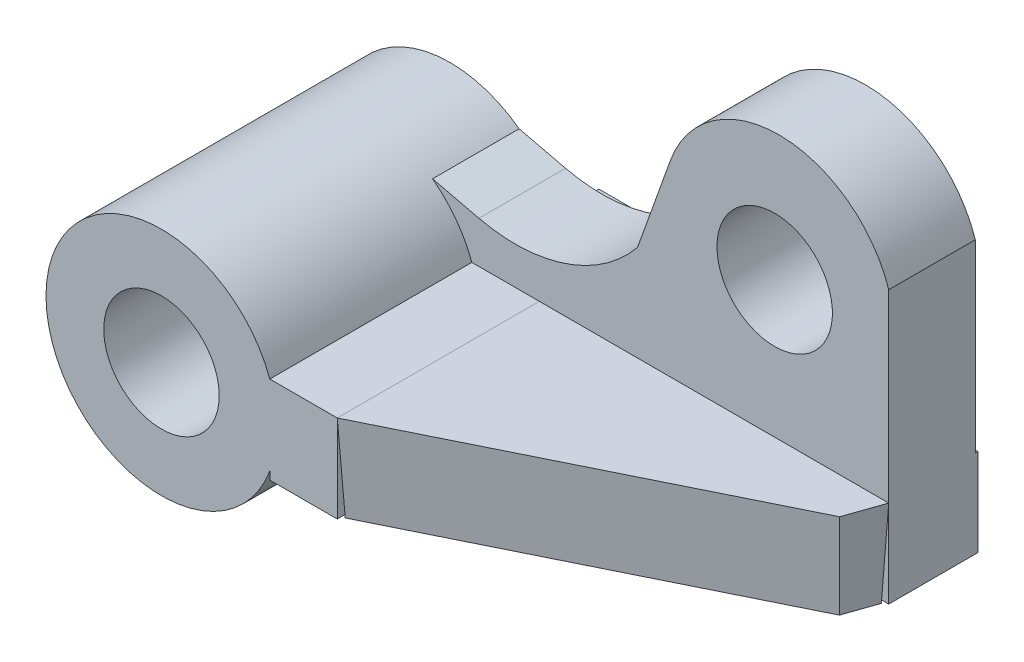
ISO-10303-21;
HEADER;
FILE_DESCRIPTION(('STEP AP214'),'2;1');
FILE_NAME('part.step','',(''),(''),'','','');
FILE_SCHEMA(('AUTOMOTIVE_DESIGN { 1 0 10303 214 1 1 1 1 }'));
ENDSEC;
DATA;
#1=APPLICATION_CONTEXT('core data for automotive mechanical design processes');
#2=APPLICATION_PROTOCOL_DEFINITION('international standard','automotive_design',2000,#1);
#3=PRODUCT_CONTEXT('',#1,'mechanical');
#4=PRODUCT('Part','Part','',(#3));
#5=PRODUCT_RELATED_PRODUCT_CATEGORY('part','',(#4));
#6=PRODUCT_DEFINITION_FORMATION('','',#4);
#7=PRODUCT_DEFINITION_CONTEXT('part definition',#1,'design');
#8=PRODUCT_DEFINITION('design','',#6,#7);
#9=PRODUCT_DEFINITION_SHAPE('','',#8);
#10=(LENGTH_UNIT() NAMED_UNIT(*) SI_UNIT(.MILLI.,.METRE.));
#11=(NAMED_UNIT(*) PLANE_ANGLE_UNIT() SI_UNIT($,.RADIAN.));
#12=(NAMED_UNIT(*) SI_UNIT($,.STERADIAN.) SOLID_ANGLE_UNIT());
#13=UNCERTAINTY_MEASURE_WITH_UNIT(LENGTH_MEASURE(1.E-05),#10,'distance_accuracy_value','');
#14=(GEOMETRIC_REPRESENTATION_CONTEXT(3) GLOBAL_UNCERTAINTY_ASSIGNED_CONTEXT((#13)) GLOBAL_UNIT_ASSIGNED_CONTEXT((#10,
#11,#12)) REPRESENTATION_CONTEXT('',''));
#15=CARTESIAN_POINT('',(0.,0.,0.));
#16=DIRECTION('',(0.,0.,1.));
#17=DIRECTION('',(1.,0.,0.));
#18=AXIS2_PLACEMENT_3D('',#15,#16,#17);
#19=CARTESIAN_POINT('',(30.4592069051177,6.89696913346013,-10.));
#20=DIRECTION('',(-0.999390827019096,-0.034899496702501,0.));
#21=DIRECTION('',(0.034899496702501,-0.999390827019096,0.));
#22=AXIS2_PLACEMENT_3D('',#19,#20,#21);
#23=PLANE('',#22);
#24=DIRECTION('',(0.,0.,1.));
#25=VECTOR('',#24,1.);
#26=CARTESIAN_POINT('',(30.4592069051177,6.89696913346013,-10.));
#27=LINE('',#26,#25);
#28=CARTESIAN_POINT('',(30.4592069051177,6.89696913346013,-10.));
#29=VERTEX_POINT('',#28);
#30=CARTESIAN_POINT('',(30.4592069051177,6.89696913346013,25.));
#31=VERTEX_POINT('',#30);
#32=EDGE_CURVE('E98',#29,#31,#27,.T.);
#33=ORIENTED_EDGE('',*,*,#32,.F.);
#34=DIRECTION('',(-0.0348782627423747,0.998782765958718,-0.0348782627423747));
#35=VECTOR('',#34,1.);
#36=CARTESIAN_POINT('',(30.5328336841421,4.78857404091006,-9.92637322097553));
#37=LINE('',#36,#35);
#38=CARTESIAN_POINT('',(30.9886318992094,-8.26377909165649,-9.47057500590828));
#39=VERTEX_POINT('',#38);
#40=EDGE_CURVE('E12',#39,#29,#37,.T.);
#41=ORIENTED_EDGE('',*,*,#40,.F.);
#42=DIRECTION('',(0.,0.,1.));
#43=VECTOR('',#42,1.);
#44=CARTESIAN_POINT('',(30.9886318992094,-8.26377909165649,-10.));
#45=LINE('',#44,#43);
#46=CARTESIAN_POINT('',(30.9886318992094,-8.26377909165649,24.1495847439697));
#47=VERTEX_POINT('',#46);
#48=EDGE_CURVE('E100',#39,#47,#45,.T.);
#49=ORIENTED_EDGE('',*,*,#48,.T.);
#50=DIRECTION('',(-0.0348447877303247,0.997824167035008,0.0559711751611641));
#51=VECTOR('',#50,1.);
#52=CARTESIAN_POINT('',(30.5274675352304,4.94224044029957,24.8903529642877));
#53=LINE('',#52,#51);
#54=EDGE_CURVE('E85',#47,#31,#53,.T.);
#55=ORIENTED_EDGE('',*,*,#54,.T.);
#56=EDGE_LOOP('',(#33,#41,#49,#55));
#57=FACE_BOUND('',#56,.T.);
#58=ADVANCED_FACE('F48',(#57),#23,.T.);
#59=CARTESIAN_POINT('',(90.9829963538868,6.89696913346013,-10.));
#60=DIRECTION('',(0.,-0.034899496702501,-0.999390827019096));
#61=DIRECTION('',(0.,0.999390827019096,-0.034899496702501));
#62=AXIS2_PLACEMENT_3D('',#59,#60,#61);
#63=PLANE('',#62);
#64=DIRECTION('',(-1.,0.,0.));
#65=VECTOR('',#64,1.);
#66=CARTESIAN_POINT('',(90.9829963538868,6.89696913346013,-10.));
#67=LINE('',#66,#65);
#68=CARTESIAN_POINT('',(90.9829963538868,6.89696913346013,-10.));
#69=VERTEX_POINT('',#68);
#70=EDGE_CURVE('E110',#69,#29,#67,.T.);
#71=ORIENTED_EDGE('',*,*,#70,.F.);
#72=DIRECTION('',(0.0489911936536833,0.998190769032111,-0.0348575897541608));
#73=VECTOR('',#72,1.);
#74=CARTESIAN_POINT('',(90.9669756205997,6.57054826293724,-9.98860113202318));
#75=LINE('',#74,#73);
#76=CARTESIAN_POINT('',(90.238906972103,-8.26377909165649,-9.47057500590828));
#77=VERTEX_POINT('',#76);
#78=EDGE_CURVE('E58',#77,#69,#75,.T.);
#79=ORIENTED_EDGE('',*,*,#78,.F.);
#80=DIRECTION('',(-1.,0.,0.));
#81=VECTOR('',#80,1.);
#82=CARTESIAN_POINT('',(90.9829963538868,-8.26377909165649,-9.47057500590828));
#83=LINE('',#82,#81);
#84=EDGE_CURVE('E101',#77,#39,#83,.T.);
#85=ORIENTED_EDGE('',*,*,#84,.T.);
#86=ORIENTED_EDGE('',*,*,#40,.T.);
#87=EDGE_LOOP('',(#71,#79,#85,#86));
#88=FACE_BOUND('',#87,.T.);
#89=ADVANCED_FACE('F50',(#88),#63,.T.);
#90=CARTESIAN_POINT('',(88.7949069213789,6.89696913346013,-3.69390138226322));
#91=DIRECTION('',(0.9441690688801,-0.034899496702501,0.327607683823194));
#92=DIRECTION('',(0.327807375219118,0.,-0.944744581753159));
#93=AXIS2_PLACEMENT_3D('',#90,#91,#92);
#94=PLANE('',#93);
#95=DIRECTION('',(0.327807375219118,0.,-0.944744581753159));
#96=VECTOR('',#95,1.);
#97=CARTESIAN_POINT('',(88.7949069213789,6.89696913346013,-3.69390138226322));
#98=LINE('',#97,#96);
#99=CARTESIAN_POINT('',(88.7949069213789,6.89696913346013,-3.69390138226322));
#100=VERTEX_POINT('',#99);
#101=EDGE_CURVE('E107',#100,#69,#98,.T.);
#102=ORIENTED_EDGE('',*,*,#101,.F.);
#103=DIRECTION('',(0.0282676962699882,0.999288098605392,0.024984661959042));
#104=VECTOR('',#103,1.);
#105=CARTESIAN_POINT('',(88.7685583635746,5.96552427931182,-3.71718979613192));
#106=LINE('',#105,#104);
#107=CARTESIAN_POINT('',(88.3660421859223,-8.26377909165649,-4.07295740222315));
#108=VERTEX_POINT('',#107);
#109=EDGE_CURVE('E78',#108,#100,#106,.T.);
#110=ORIENTED_EDGE('',*,*,#109,.F.);
#111=DIRECTION('',(0.327807375219118,0.,-0.944744581753159));
#112=VECTOR('',#111,1.);
#113=CARTESIAN_POINT('',(88.2947355267661,-8.26377909165649,-3.86745079995183));
#114=LINE('',#113,#112);
#115=EDGE_CURVE('E118',#108,#77,#114,.T.);
#116=ORIENTED_EDGE('',*,*,#115,.T.);
#117=ORIENTED_EDGE('',*,*,#78,.T.);
#118=EDGE_LOOP('',(#102,#110,#116,#117));
#119=FACE_BOUND('',#118,.T.);
#120=ADVANCED_FACE('F123',(#119),#94,.T.);
#121=CARTESIAN_POINT('',(30.4592069051177,6.89696913346013,25.));
#122=DIRECTION('',(0.441102964200211,-0.034899496702501,0.896777675961941));
#123=DIRECTION('',(0.897324301681634,0.,-0.441371835997233));
#124=AXIS2_PLACEMENT_3D('',#121,#122,#123);
#125=PLANE('',#124);
#126=DIRECTION('',(0.897324301681634,0.,-0.441371835997233));
#127=VECTOR('',#126,1.);
#128=CARTESIAN_POINT('',(30.4592069051177,6.89696913346013,25.));
#129=LINE('',#128,#127);
#130=EDGE_CURVE('E104',#31,#100,#129,.T.);
#131=ORIENTED_EDGE('',*,*,#130,.F.);
#132=ORIENTED_EDGE('',*,*,#54,.F.);
#133=DIRECTION('',(0.897324301681634,0.,-0.441371835997233));
#134=VECTOR('',#133,1.);
#135=CARTESIAN_POINT('',(30.2255336234526,-8.26377909165649,24.5249340868838));
#136=LINE('',#135,#134);
#137=EDGE_CURVE('E52',#47,#108,#136,.T.);
#138=ORIENTED_EDGE('',*,*,#137,.T.);
#139=ORIENTED_EDGE('',*,*,#109,.T.);
#140=EDGE_LOOP('',(#131,#132,#138,#139));
#141=FACE_BOUND('',#140,.T.);
#142=ADVANCED_FACE('F105',(#141),#125,.T.);
#143=CARTESIAN_POINT('',(0.,-8.26377909165649,0.));
#144=DIRECTION('',(0.,-1.,0.));
#145=DIRECTION('',(0.,0.,-1.));
#146=AXIS2_PLACEMENT_3D('',#143,#144,#145);
#147=PLANE('',#146);
#148=ORIENTED_EDGE('',*,*,#48,.F.);
#149=ORIENTED_EDGE('',*,*,#84,.F.);
#150=ORIENTED_EDGE('',*,*,#115,.F.);
#151=ORIENTED_EDGE('',*,*,#137,.F.);
#152=EDGE_LOOP('',(#148,#149,#150,#151));
#153=FACE_BOUND('',#152,.T.);
#154=ADVANCED_FACE('F121',(#153),#147,.T.);
#155=CARTESIAN_POINT('',(0.,6.89696913346013,0.));
#156=DIRECTION('',(0.,-1.,0.));
#157=DIRECTION('',(0.,0.,-1.));
#158=AXIS2_PLACEMENT_3D('',#155,#156,#157);
#159=PLANE('',#158);
#160=ORIENTED_EDGE('',*,*,#32,.T.);
#161=ORIENTED_EDGE('',*,*,#130,.T.);
#162=ORIENTED_EDGE('',*,*,#101,.T.);
#163=ORIENTED_EDGE('',*,*,#70,.T.);
#164=EDGE_LOOP('',(#160,#161,#162,#163));
#165=FACE_BOUND('',#164,.T.);
#166=ADVANCED_FACE('F109',(#165),#159,.F.);
#167=CLOSED_SHELL('',(#58,#89,#120,#142,#154,#166));
#168=MANIFOLD_SOLID_BREP('B2',#167);
#169=CARTESIAN_POINT('',(30.4592069051177,6.89696913346013,-32.0000000000001));
#170=DIRECTION('',(1.,0.,0.));
#171=DIRECTION('',(0.,0.,-1.));
#172=AXIS2_PLACEMENT_3D('',#169,#170,#171);
#173=PLANE('',#172);
#174=DIRECTION('',(0.,-1.,0.));
#175=VECTOR('',#174,1.);
#176=CARTESIAN_POINT('',(30.4592069051177,6.89696913346013,-10.));
#177=LINE('',#176,#175);
#178=CARTESIAN_POINT('',(30.4592069051177,6.89696913346013,-10.));
#179=VERTEX_POINT('',#178);
#180=CARTESIAN_POINT('',(30.4592069051177,-8.26377909165649,-10.));
#181=VERTEX_POINT('',#180);
#182=EDGE_CURVE('E294',#179,#181,#177,.T.);
#183=ORIENTED_EDGE('',*,*,#182,.F.);
#184=DIRECTION('',(0.,0.,1.));
#185=VECTOR('',#184,1.);
#186=CARTESIAN_POINT('',(30.4592069051177,6.89696913346013,-32.0000000000001));
#187=LINE('',#186,#185);
#188=CARTESIAN_POINT('',(30.4592069051177,6.89696913346013,25.));
#189=VERTEX_POINT('',#188);
#190=EDGE_CURVE('E346',#179,#189,#187,.T.);
#191=ORIENTED_EDGE('',*,*,#190,.T.);
#192=DIRECTION('',(0.,1.,0.));
#193=VECTOR('',#192,1.);
#194=CARTESIAN_POINT('',(30.4592069051177,6.89696913346013,25.));
#195=LINE('',#194,#193);
#196=CARTESIAN_POINT('',(30.4592069051177,-8.26377909165649,25.));
#197=VERTEX_POINT('',#196);
#198=EDGE_CURVE('E333',#197,#189,#195,.T.);
#199=ORIENTED_EDGE('',*,*,#198,.F.);
#200=DIRECTION('',(0.,0.,1.));
#201=VECTOR('',#200,1.);
#202=CARTESIAN_POINT('',(30.4592069051177,-8.26377909165649,-32.0000000000001));
#203=LINE('',#202,#201);
#204=EDGE_CURVE('E349',#181,#197,#203,.T.);
#205=ORIENTED_EDGE('',*,*,#204,.F.);
#206=EDGE_LOOP('',(#183,#191,#199,#205));
#207=FACE_BOUND('',#206,.T.);
#208=ADVANCED_FACE('F171',(#207),#173,.T.);
#209=CARTESIAN_POINT('',(0.,0.,25.));
#210=DIRECTION('',(0.,0.,1.));
#211=DIRECTION('',(1.,0.,0.));
#212=AXIS2_PLACEMENT_3D('',#209,#210,#211);
#213=PLANE('',#212);
#214=CARTESIAN_POINT('',(0.,0.,25.));
#215=DIRECTION('',(0.,0.,1.));
#216=DIRECTION('',(1.,0.,0.));
#217=AXIS2_PLACEMENT_3D('',#214,#215,#216);
#218=CIRCLE('',#217,20.);
#219=CARTESIAN_POINT('',(18.7731674677476,6.89696913346013,25.));
#220=VERTEX_POINT('',#219);
#221=CARTESIAN_POINT('',(18.7731674677476,-6.89696913346013,25.));
#222=VERTEX_POINT('',#221);
#223=EDGE_CURVE('E46',#220,#222,#218,.T.);
#224=ORIENTED_EDGE('',*,*,#223,.T.);
#225=DIRECTION('',(0.,-1.,0.));
#226=VECTOR('',#225,1.);
#227=CARTESIAN_POINT('',(18.7731674677476,6.89696913346013,25.));
#228=LINE('',#227,#226);
#229=CARTESIAN_POINT('',(18.7731674677476,-8.26377909165649,25.));
#230=VERTEX_POINT('',#229);
#231=EDGE_CURVE('E314',#222,#230,#228,.T.);
#232=ORIENTED_EDGE('',*,*,#231,.T.);
#233=DIRECTION('',(1.,0.,0.));
#234=VECTOR('',#233,1.);
#235=CARTESIAN_POINT('',(18.7731674677476,-8.26377909165649,25.));
#236=LINE('',#235,#234);
#237=EDGE_CURVE('E330',#230,#197,#236,.T.);
#238=ORIENTED_EDGE('',*,*,#237,.T.);
#239=ORIENTED_EDGE('',*,*,#198,.T.);
#240=DIRECTION('',(-1.,0.,0.));
#241=VECTOR('',#240,1.);
#242=CARTESIAN_POINT('',(18.7731674677476,6.89696913346013,25.));
#243=LINE('',#242,#241);
#244=EDGE_CURVE('E319',#189,#220,#243,.T.);
#245=ORIENTED_EDGE('',*,*,#244,.T.);
#246=EDGE_LOOP('',(#224,#232,#238,#239,#245));
#247=FACE_BOUND('',#246,.T.);
#248=CARTESIAN_POINT('',(0.,0.,25.));
#249=DIRECTION('',(0.,0.,1.));
#250=DIRECTION('',(1.,0.,0.));
#251=AXIS2_PLACEMENT_3D('',#248,#249,#250);
#252=CIRCLE('',#251,10.);
#253=CARTESIAN_POINT('',(10.,0.,25.));
#254=VERTEX_POINT('',#253);
#255=EDGE_CURVE('E402',#254,#254,#252,.T.);
#256=ORIENTED_EDGE('',*,*,#255,.F.);
#257=EDGE_LOOP('',(#256));
#258=FACE_BOUND('',#257,.T.);
#259=ADVANCED_FACE('F427',(#247,#258),#213,.T.);
#260=CARTESIAN_POINT('',(0.,0.,-25.));
#261=DIRECTION('',(0.,0.,1.));
#262=DIRECTION('',(1.,0.,0.));
#263=AXIS2_PLACEMENT_3D('',#260,#261,#262);
#264=PLANE('',#263);
#265=DIRECTION('',(-1.,0.,0.));
#266=VECTOR('',#265,1.);
#267=CARTESIAN_POINT('',(0.,6.89696913346013,-25.));
#268=LINE('',#267,#266);
#269=CARTESIAN_POINT('',(90.9829963538868,6.89696913346013,-25.));
#270=VERTEX_POINT('',#269);
#271=CARTESIAN_POINT('',(18.7731674677476,6.89696913346013,-25.));
#272=VERTEX_POINT('',#271);
#273=EDGE_CURVE('E385',#270,#272,#268,.T.);
#274=ORIENTED_EDGE('',*,*,#273,.T.);
#275=DIRECTION('',(0.,-1.,0.));
#276=VECTOR('',#275,1.);
#277=CARTESIAN_POINT('',(18.7731674677476,0.,-25.));
#278=LINE('',#277,#276);
#279=CARTESIAN_POINT('',(18.7731674677476,-6.89696913346013,-25.));
#280=VERTEX_POINT('',#279);
#281=EDGE_CURVE('E194',#272,#280,#278,.T.);
#282=ORIENTED_EDGE('',*,*,#281,.T.);
#283=CARTESIAN_POINT('',(0.,0.,-25.));
#284=DIRECTION('',(0.,0.,1.));
#285=DIRECTION('',(1.,0.,0.));
#286=AXIS2_PLACEMENT_3D('',#283,#284,#285);
#287=CIRCLE('',#286,20.);
#288=CARTESIAN_POINT('',(11.9590658316496,16.0306189660372,-25.));
#289=VERTEX_POINT('',#288);
#290=EDGE_CURVE('E175',#289,#280,#287,.T.);
#291=ORIENTED_EDGE('',*,*,#290,.F.);
#292=DIRECTION('',(0.9731848873173,-0.230024292406725,0.));
#293=VECTOR('',#292,1.);
#294=CARTESIAN_POINT('',(4.22132111191081,17.8595306940935,-25.));
#295=LINE('',#294,#293);
#296=CARTESIAN_POINT('',(20.,14.1300446594812,-25.));
#297=VERTEX_POINT('',#296);
#298=EDGE_CURVE('E387',#289,#297,#295,.T.);
#299=ORIENTED_EDGE('',*,*,#298,.T.);
#300=CARTESIAN_POINT('',(26.2773629397795,40.6882602343703,-25.));
#301=DIRECTION('',(0.,0.,-1.));
#302=DIRECTION('',(-1.,0.,0.));
#303=AXIS2_PLACEMENT_3D('',#300,#301,#302);
#304=CIRCLE('',#303,27.29);
#305=CARTESIAN_POINT('',(47.4742402846287,23.4999941546455,-25.));
#306=VERTEX_POINT('',#305);
#307=EDGE_CURVE('E359',#297,#306,#304,.F.);
#308=ORIENTED_EDGE('',*,*,#307,.T.);
#309=DIRECTION('',(0.337138537440479,0.941455047558031,0.));
#310=VECTOR('',#309,1.);
#311=CARTESIAN_POINT('',(34.6192880847532,-12.3972952106402,-25.));
#312=LINE('',#311,#310);
#313=CARTESIAN_POINT('',(53.1597930032671,39.3768272979475,-25.));
#314=VERTEX_POINT('',#313);
#315=EDGE_CURVE('E376',#306,#314,#312,.T.);
#316=ORIENTED_EDGE('',*,*,#315,.T.);
#317=CARTESIAN_POINT('',(71.9888939544277,32.634056549138,-25.));
#318=DIRECTION('',(0.,0.,-1.));
#319=DIRECTION('',(-1.,0.,0.));
#320=AXIS2_PLACEMENT_3D('',#317,#318,#319);
#321=CIRCLE('',#320,20.);
#322=CARTESIAN_POINT('',(90.9829963538868,38.8969691334601,-25.));
#323=VERTEX_POINT('',#322);
#324=EDGE_CURVE('E379',#314,#323,#321,.T.);
#325=ORIENTED_EDGE('',*,*,#324,.T.);
#326=DIRECTION('',(0.,-1.,0.));
#327=VECTOR('',#326,1.);
#328=CARTESIAN_POINT('',(90.9829963538868,0.,-25.));
#329=LINE('',#328,#327);
#330=EDGE_CURVE('E382',#323,#270,#329,.T.);
#331=ORIENTED_EDGE('',*,*,#330,.T.);
#332=EDGE_LOOP('',(#274,#282,#291,#299,#308,#316,#325,#331));
#333=FACE_BOUND('',#332,.T.);
#334=CARTESIAN_POINT('',(0.,0.,-25.));
#335=DIRECTION('',(0.,0.,1.));
#336=DIRECTION('',(1.,0.,0.));
#337=AXIS2_PLACEMENT_3D('',#334,#335,#336);
#338=CIRCLE('',#337,10.);
#339=CARTESIAN_POINT('',(10.,0.,-25.));
#340=VERTEX_POINT('',#339);
#341=EDGE_CURVE('E394',#340,#340,#338,.T.);
#342=ORIENTED_EDGE('',*,*,#341,.T.);
#343=EDGE_LOOP('',(#342));
#344=FACE_BOUND('',#343,.T.);
#345=CARTESIAN_POINT('',(71.2258627337655,30.5033016387367,-25.));
#346=DIRECTION('',(0.,0.,-1.));
#347=DIRECTION('',(-1.,0.,0.));
#348=AXIS2_PLACEMENT_3D('',#345,#346,#347);
#349=CIRCLE('',#348,10.);
#350=CARTESIAN_POINT('',(61.2258627337655,30.5033016387367,-25.));
#351=VERTEX_POINT('',#350);
#352=EDGE_CURVE('E354',#351,#351,#349,.T.);
#353=ORIENTED_EDGE('',*,*,#352,.F.);
#354=EDGE_LOOP('',(#353));
#355=FACE_BOUND('',#354,.T.);
#356=ADVANCED_FACE('F408',(#333,#344,#355),#264,.F.);
#357=CARTESIAN_POINT('',(0.,0.,25.));
#358=DIRECTION('',(0.,0.,-1.));
#359=DIRECTION('',(-1.,0.,0.));
#360=AXIS2_PLACEMENT_3D('',#357,#358,#359);
#361=CYLINDRICAL_SURFACE('',#360,20.);
#362=ORIENTED_EDGE('',*,*,#290,.T.);
#363=DIRECTION('',(0.,0.,-1.));
#364=VECTOR('',#363,1.);
#365=CARTESIAN_POINT('',(18.7731674677476,-6.89696913346013,25.));
#366=LINE('',#365,#364);
#367=EDGE_CURVE('E341',#280,#222,#366,.F.);
#368=ORIENTED_EDGE('',*,*,#367,.T.);
#369=ORIENTED_EDGE('',*,*,#223,.F.);
#370=DIRECTION('',(0.,0.,1.));
#371=VECTOR('',#370,1.);
#372=CARTESIAN_POINT('',(18.7731674677476,6.89696913346013,-32.0000000000001));
#373=LINE('',#372,#371);
#374=CARTESIAN_POINT('',(18.7731674677476,6.89696913346013,-10.));
#375=VERTEX_POINT('',#374);
#376=EDGE_CURVE('E342',#375,#220,#373,.T.);
#377=ORIENTED_EDGE('',*,*,#376,.F.);
#378=CARTESIAN_POINT('',(0.,0.,-10.));
#379=DIRECTION('',(0.,0.,-1.));
#380=DIRECTION('',(-1.,0.,0.));
#381=AXIS2_PLACEMENT_3D('',#378,#379,#380);
#382=CIRCLE('',#381,20.);
#383=CARTESIAN_POINT('',(11.9590658316496,16.0306189660372,-10.));
#384=VERTEX_POINT('',#383);
#385=EDGE_CURVE('E364',#384,#375,#382,.T.);
#386=ORIENTED_EDGE('',*,*,#385,.F.);
#387=DIRECTION('',(0.,0.,-1.));
#388=VECTOR('',#387,1.);
#389=CARTESIAN_POINT('',(11.9590658316496,16.0306189660372,-10.));
#390=LINE('',#389,#388);
#391=EDGE_CURVE('E397',#384,#289,#390,.T.);
#392=ORIENTED_EDGE('',*,*,#391,.T.);
#393=EDGE_LOOP('',(#362,#368,#369,#377,#386,#392));
#394=FACE_BOUND('',#393,.T.);
#395=ADVANCED_FACE('F173',(#394),#361,.T.);
#396=CARTESIAN_POINT('',(0.,0.,25.));
#397=DIRECTION('',(0.,0.,-1.));
#398=DIRECTION('',(-1.,0.,0.));
#399=AXIS2_PLACEMENT_3D('',#396,#397,#398);
#400=CYLINDRICAL_SURFACE('',#399,10.);
#401=ORIENTED_EDGE('',*,*,#255,.T.);
#402=EDGE_LOOP('',(#401));
#403=FACE_BOUND('',#402,.T.);
#404=ORIENTED_EDGE('',*,*,#341,.F.);
#405=EDGE_LOOP('',(#404));
#406=FACE_BOUND('',#405,.T.);
#407=ADVANCED_FACE('F411',(#403,#406),#400,.F.);
#408=CARTESIAN_POINT('',(34.6192880847532,-12.3972952106402,-10.));
#409=DIRECTION('',(-0.941455047558031,0.337138537440478,0.));
#410=DIRECTION('',(-0.337138537440478,-0.941455047558031,0.));
#411=AXIS2_PLACEMENT_3D('',#408,#409,#410);
#412=PLANE('',#411);
#413=ORIENTED_EDGE('',*,*,#315,.F.);
#414=DIRECTION('',(0.,0.,-1.));
#415=VECTOR('',#414,1.);
#416=CARTESIAN_POINT('',(47.4742402846287,23.4999941546455,-10.));
#417=LINE('',#416,#415);
#418=CARTESIAN_POINT('',(47.4742402846287,23.4999941546455,-10.));
#419=VERTEX_POINT('',#418);
#420=EDGE_CURVE('E392',#419,#306,#417,.T.);
#421=ORIENTED_EDGE('',*,*,#420,.F.);
#422=DIRECTION('',(0.337138537440479,0.941455047558031,0.));
#423=VECTOR('',#422,1.);
#424=CARTESIAN_POINT('',(34.6192880847532,-12.3972952106402,-10.));
#425=LINE('',#424,#423);
#426=CARTESIAN_POINT('',(53.1597930032671,39.3768272979475,-10.));
#427=VERTEX_POINT('',#426);
#428=EDGE_CURVE('E358',#419,#427,#425,.T.);
#429=ORIENTED_EDGE('',*,*,#428,.T.);
#430=DIRECTION('',(0.,0.,-1.));
#431=VECTOR('',#430,1.);
#432=CARTESIAN_POINT('',(53.1597930032671,39.3768272979475,-10.));
#433=LINE('',#432,#431);
#434=EDGE_CURVE('E373',#427,#314,#433,.T.);
#435=ORIENTED_EDGE('',*,*,#434,.T.);
#436=EDGE_LOOP('',(#413,#421,#429,#435));
#437=FACE_BOUND('',#436,.T.);
#438=ADVANCED_FACE('F413',(#437),#412,.T.);
#439=CARTESIAN_POINT('',(26.2773629397795,40.6882602343703,-10.));
#440=DIRECTION('',(0.,0.,-1.));
#441=DIRECTION('',(-1.,0.,0.));
#442=AXIS2_PLACEMENT_3D('',#439,#440,#441);
#443=CYLINDRICAL_SURFACE('',#442,27.29);
#444=ORIENTED_EDGE('',*,*,#307,.F.);
#445=DIRECTION('',(0.,0.,-1.));
#446=VECTOR('',#445,1.);
#447=CARTESIAN_POINT('',(20.,14.1300446594812,-10.));
#448=LINE('',#447,#446);
#449=CARTESIAN_POINT('',(20.,14.1300446594812,-10.));
#450=VERTEX_POINT('',#449);
#451=EDGE_CURVE('E395',#450,#297,#448,.T.);
#452=ORIENTED_EDGE('',*,*,#451,.F.);
#453=CARTESIAN_POINT('',(26.2773629397795,40.6882602343703,-10.));
#454=DIRECTION('',(0.,0.,-1.));
#455=DIRECTION('',(-1.,0.,0.));
#456=AXIS2_PLACEMENT_3D('',#453,#454,#455);
#457=CIRCLE('',#456,27.29);
#458=EDGE_CURVE('E370',#450,#419,#457,.F.);
#459=ORIENTED_EDGE('',*,*,#458,.T.);
#460=ORIENTED_EDGE('',*,*,#420,.T.);
#461=EDGE_LOOP('',(#444,#452,#459,#460));
#462=FACE_BOUND('',#461,.T.);
#463=ADVANCED_FACE('F420',(#462),#443,.F.);
#464=CARTESIAN_POINT('',(4.22132111191081,17.8595306940935,-10.));
#465=DIRECTION('',(0.230024292406725,0.9731848873173,0.));
#466=DIRECTION('',(-0.9731848873173,0.230024292406725,0.));
#467=AXIS2_PLACEMENT_3D('',#464,#465,#466);
#468=PLANE('',#467);
#469=ORIENTED_EDGE('',*,*,#298,.F.);
#470=ORIENTED_EDGE('',*,*,#391,.F.);
#471=DIRECTION('',(0.9731848873173,-0.230024292406725,0.));
#472=VECTOR('',#471,1.);
#473=CARTESIAN_POINT('',(4.22132111191081,17.8595306940935,-10.));
#474=LINE('',#473,#472);
#475=EDGE_CURVE('E367',#384,#450,#474,.T.);
#476=ORIENTED_EDGE('',*,*,#475,.T.);
#477=ORIENTED_EDGE('',*,*,#451,.T.);
#478=EDGE_LOOP('',(#469,#470,#476,#477));
#479=FACE_BOUND('',#478,.T.);
#480=ADVANCED_FACE('F476',(#479),#468,.T.);
#481=CARTESIAN_POINT('',(90.9829963538868,0.,-10.));
#482=DIRECTION('',(1.,0.,0.));
#483=DIRECTION('',(0.,0.,-1.));
#484=AXIS2_PLACEMENT_3D('',#481,#482,#483);
#485=PLANE('',#484);
#486=ORIENTED_EDGE('',*,*,#330,.F.);
#487=DIRECTION('',(0.,0.,-1.));
#488=VECTOR('',#487,1.);
#489=CARTESIAN_POINT('',(90.9829963538868,38.8969691334601,-10.));
#490=LINE('',#489,#488);
#491=CARTESIAN_POINT('',(90.9829963538868,38.8969691334601,-10.));
#492=VERTEX_POINT('',#491);
#493=EDGE_CURVE('E284',#492,#323,#490,.T.);
#494=ORIENTED_EDGE('',*,*,#493,.F.);
#495=DIRECTION('',(0.,-1.,0.));
#496=VECTOR('',#495,1.);
#497=CARTESIAN_POINT('',(90.9829963538868,0.,-10.));
#498=LINE('',#497,#496);
#499=CARTESIAN_POINT('',(90.9829963538868,-8.26377909165649,-10.));
#500=VERTEX_POINT('',#499);
#501=EDGE_CURVE('E279',#492,#500,#498,.T.);
#502=ORIENTED_EDGE('',*,*,#501,.T.);
#503=DIRECTION('',(0.,0.,-1.));
#504=VECTOR('',#503,1.);
#505=CARTESIAN_POINT('',(90.9829963538868,-8.26377909165649,-10.));
#506=LINE('',#505,#504);
#507=CARTESIAN_POINT('',(90.9829963538868,-8.26377909165649,-25.4661949761496));
#508=VERTEX_POINT('',#507);
#509=EDGE_CURVE('E283',#500,#508,#506,.T.);
#510=ORIENTED_EDGE('',*,*,#509,.T.);
#511=DIRECTION('',(0.,1.,0.));
#512=VECTOR('',#511,1.);
#513=CARTESIAN_POINT('',(90.9829963538868,6.89696913346013,-25.4661949761496));
#514=LINE('',#513,#512);
#515=CARTESIAN_POINT('',(90.9829963538868,6.89696913346013,-25.4661949761496));
#516=VERTEX_POINT('',#515);
#517=EDGE_CURVE('E302',#508,#516,#514,.T.);
#518=ORIENTED_EDGE('',*,*,#517,.T.);
#519=DIRECTION('',(0.,0.,1.));
#520=VECTOR('',#519,1.);
#521=CARTESIAN_POINT('',(90.9829963538868,6.89696913346013,-10.));
#522=LINE('',#521,#520);
#523=EDGE_CURVE('E297',#516,#270,#522,.T.);
#524=ORIENTED_EDGE('',*,*,#523,.T.);
#525=EDGE_LOOP('',(#486,#494,#502,#510,#518,#524));
#526=FACE_BOUND('',#525,.T.);
#527=ADVANCED_FACE('F281',(#526),#485,.T.);
#528=CARTESIAN_POINT('',(71.2258627337655,30.5033016387367,-10.));
#529=DIRECTION('',(0.,0.,-1.));
#530=DIRECTION('',(-1.,0.,0.));
#531=AXIS2_PLACEMENT_3D('',#528,#529,#530);
#532=CYLINDRICAL_SURFACE('',#531,10.);
#533=CARTESIAN_POINT('',(71.2258627337655,30.5033016387367,-10.));
#534=DIRECTION('',(0.,0.,-1.));
#535=DIRECTION('',(-1.,0.,0.));
#536=AXIS2_PLACEMENT_3D('',#533,#534,#535);
#537=CIRCLE('',#536,10.);
#538=CARTESIAN_POINT('',(61.2258627337655,30.5033016387367,-10.));
#539=VERTEX_POINT('',#538);
#540=EDGE_CURVE('E355',#539,#539,#537,.T.);
#541=ORIENTED_EDGE('',*,*,#540,.F.);
#542=EDGE_LOOP('',(#541));
#543=FACE_BOUND('',#542,.T.);
#544=ORIENTED_EDGE('',*,*,#352,.T.);
#545=EDGE_LOOP('',(#544));
#546=FACE_BOUND('',#545,.T.);
#547=ADVANCED_FACE('F489',(#543,#546),#532,.F.);
#548=CARTESIAN_POINT('',(71.9888939544277,32.634056549138,-10.));
#549=DIRECTION('',(0.,0.,-1.));
#550=DIRECTION('',(-1.,0.,0.));
#551=AXIS2_PLACEMENT_3D('',#548,#549,#550);
#552=CYLINDRICAL_SURFACE('',#551,20.);
#553=ORIENTED_EDGE('',*,*,#324,.F.);
#554=ORIENTED_EDGE('',*,*,#434,.F.);
#555=CARTESIAN_POINT('',(71.9888939544277,32.634056549138,-10.));
#556=DIRECTION('',(0.,0.,-1.));
#557=DIRECTION('',(-1.,0.,0.));
#558=AXIS2_PLACEMENT_3D('',#555,#556,#557);
#559=CIRCLE('',#558,20.);
#560=EDGE_CURVE('E289',#427,#492,#559,.T.);
#561=ORIENTED_EDGE('',*,*,#560,.T.);
#562=ORIENTED_EDGE('',*,*,#493,.T.);
#563=EDGE_LOOP('',(#553,#554,#561,#562));
#564=FACE_BOUND('',#563,.T.);
#565=ADVANCED_FACE('F466',(#564),#552,.T.);
#566=CARTESIAN_POINT('',(0.,0.,-10.));
#567=DIRECTION('',(0.,0.,-1.));
#568=DIRECTION('',(-1.,0.,0.));
#569=AXIS2_PLACEMENT_3D('',#566,#567,#568);
#570=PLANE('',#569);
#571=DIRECTION('',(1.,0.,0.));
#572=VECTOR('',#571,1.);
#573=CARTESIAN_POINT('',(19.9829963538868,-8.26377909165649,-10.));
#574=LINE('',#573,#572);
#575=EDGE_CURVE('E186',#181,#500,#574,.T.);
#576=ORIENTED_EDGE('',*,*,#575,.T.);
#577=ORIENTED_EDGE('',*,*,#501,.F.);
#578=ORIENTED_EDGE('',*,*,#560,.F.);
#579=ORIENTED_EDGE('',*,*,#428,.F.);
#580=ORIENTED_EDGE('',*,*,#458,.F.);
#581=ORIENTED_EDGE('',*,*,#475,.F.);
#582=ORIENTED_EDGE('',*,*,#385,.T.);
#583=DIRECTION('',(-1.,0.,0.));
#584=VECTOR('',#583,1.);
#585=CARTESIAN_POINT('',(0.,6.89696913346013,-10.));
#586=LINE('',#585,#584);
#587=EDGE_CURVE('E288',#179,#375,#586,.T.);
#588=ORIENTED_EDGE('',*,*,#587,.F.);
#589=ORIENTED_EDGE('',*,*,#182,.T.);
#590=EDGE_LOOP('',(#576,#577,#578,#579,#580,#581,#582,#588,#589));
#591=FACE_BOUND('',#590,.T.);
#592=ORIENTED_EDGE('',*,*,#540,.T.);
#593=EDGE_LOOP('',(#592));
#594=FACE_BOUND('',#593,.T.);
#595=ADVANCED_FACE('F291',(#591,#594),#570,.F.);
#596=CARTESIAN_POINT('',(18.7731674677476,6.89696913346013,-32.0000000000001));
#597=DIRECTION('',(-1.,0.,0.));
#598=DIRECTION('',(0.,0.,1.));
#599=AXIS2_PLACEMENT_3D('',#596,#597,#598);
#600=PLANE('',#599);
#601=ORIENTED_EDGE('',*,*,#281,.F.);
#602=CARTESIAN_POINT('',(18.7731674677476,6.89696913346013,-32.0000000000001));
#603=VERTEX_POINT('',#602);
#604=EDGE_CURVE('E338',#603,#272,#373,.T.);
#605=ORIENTED_EDGE('',*,*,#604,.F.);
#606=DIRECTION('',(0.,-1.,0.));
#607=VECTOR('',#606,1.);
#608=CARTESIAN_POINT('',(18.7731674677476,6.89696913346013,-32.0000000000001));
#609=LINE('',#608,#607);
#610=CARTESIAN_POINT('',(18.7731674677476,-8.26377909165649,-32.0000000000001));
#611=VERTEX_POINT('',#610);
#612=EDGE_CURVE('E315',#603,#611,#609,.T.);
#613=ORIENTED_EDGE('',*,*,#612,.T.);
#614=DIRECTION('',(0.,0.,1.));
#615=VECTOR('',#614,1.);
#616=CARTESIAN_POINT('',(18.7731674677476,-8.26377909165649,-32.0000000000001));
#617=LINE('',#616,#615);
#618=EDGE_CURVE('E328',#611,#230,#617,.T.);
#619=ORIENTED_EDGE('',*,*,#618,.T.);
#620=ORIENTED_EDGE('',*,*,#231,.F.);
#621=ORIENTED_EDGE('',*,*,#367,.F.);
#622=EDGE_LOOP('',(#601,#605,#613,#619,#620,#621));
#623=FACE_BOUND('',#622,.T.);
#624=ADVANCED_FACE('F457',(#623),#600,.T.);
#625=CARTESIAN_POINT('',(18.7731674677476,6.89696913346013,-32.0000000000001));
#626=DIRECTION('',(0.,1.,0.));
#627=DIRECTION('',(0.,0.,1.));
#628=AXIS2_PLACEMENT_3D('',#625,#626,#627);
#629=PLANE('',#628);
#630=DIRECTION('',(1.,0.,0.));
#631=VECTOR('',#630,1.);
#632=CARTESIAN_POINT('',(19.9829963538868,6.89696913346013,-25.4661949761496));
#633=LINE('',#632,#631);
#634=CARTESIAN_POINT('',(30.4592069051177,6.89696913346013,-25.4661949761496));
#635=VERTEX_POINT('',#634);
#636=EDGE_CURVE('E308',#635,#516,#633,.T.);
#637=ORIENTED_EDGE('',*,*,#636,.F.);
#638=CARTESIAN_POINT('',(30.4592069051177,6.89696913346013,-32.0000000000001));
#639=VERTEX_POINT('',#638);
#640=EDGE_CURVE('E343',#639,#635,#187,.T.);
#641=ORIENTED_EDGE('',*,*,#640,.F.);
#642=DIRECTION('',(-1.,0.,0.));
#643=VECTOR('',#642,1.);
#644=CARTESIAN_POINT('',(18.7731674677476,6.89696913346013,-32.0000000000001));
#645=LINE('',#644,#643);
#646=EDGE_CURVE('E325',#639,#603,#645,.T.);
#647=ORIENTED_EDGE('',*,*,#646,.T.);
#648=ORIENTED_EDGE('',*,*,#604,.T.);
#649=ORIENTED_EDGE('',*,*,#273,.F.);
#650=ORIENTED_EDGE('',*,*,#523,.F.);
#651=EDGE_LOOP('',(#637,#641,#647,#648,#649,#650));
#652=FACE_BOUND('',#651,.T.);
#653=ADVANCED_FACE('F445',(#652),#629,.T.);
#654=ORIENTED_EDGE('',*,*,#587,.T.);
#655=ORIENTED_EDGE('',*,*,#376,.T.);
#656=ORIENTED_EDGE('',*,*,#244,.F.);
#657=ORIENTED_EDGE('',*,*,#190,.F.);
#658=EDGE_LOOP('',(#654,#655,#656,#657));
#659=FACE_BOUND('',#658,.T.);
#660=ADVANCED_FACE('F438',(#659),#629,.T.);
#661=DIRECTION('',(0.,1.,0.));
#662=VECTOR('',#661,1.);
#663=CARTESIAN_POINT('',(30.4592069051177,6.89696913346013,-25.4661949761496));
#664=LINE('',#663,#662);
#665=CARTESIAN_POINT('',(30.4592069051177,-8.26377909165649,-25.4661949761496));
#666=VERTEX_POINT('',#665);
#667=EDGE_CURVE('E310',#666,#635,#664,.T.);
#668=ORIENTED_EDGE('',*,*,#667,.F.);
#669=CARTESIAN_POINT('',(30.4592069051177,-8.26377909165649,-32.0000000000001));
#670=VERTEX_POINT('',#669);
#671=EDGE_CURVE('E347',#670,#666,#203,.T.);
#672=ORIENTED_EDGE('',*,*,#671,.F.);
#673=DIRECTION('',(0.,1.,0.));
#674=VECTOR('',#673,1.);
#675=CARTESIAN_POINT('',(30.4592069051177,6.89696913346013,-32.0000000000001));
#676=LINE('',#675,#674);
#677=EDGE_CURVE('E322',#670,#639,#676,.T.);
#678=ORIENTED_EDGE('',*,*,#677,.T.);
#679=ORIENTED_EDGE('',*,*,#640,.T.);
#680=EDGE_LOOP('',(#668,#672,#678,#679));
#681=FACE_BOUND('',#680,.T.);
#682=ADVANCED_FACE('F430',(#681),#173,.T.);
#683=CARTESIAN_POINT('',(18.7731674677476,-8.26377909165649,-32.0000000000001));
#684=DIRECTION('',(0.,-1.,0.));
#685=DIRECTION('',(0.,0.,-1.));
#686=AXIS2_PLACEMENT_3D('',#683,#684,#685);
#687=PLANE('',#686);
#688=ORIENTED_EDGE('',*,*,#671,.T.);
#689=DIRECTION('',(1.,0.,0.));
#690=VECTOR('',#689,1.);
#691=CARTESIAN_POINT('',(19.9829963538868,-8.26377909165649,-25.4661949761496));
#692=LINE('',#691,#690);
#693=EDGE_CURVE('E296',#666,#508,#692,.T.);
#694=ORIENTED_EDGE('',*,*,#693,.T.);
#695=ORIENTED_EDGE('',*,*,#509,.F.);
#696=ORIENTED_EDGE('',*,*,#575,.F.);
#697=ORIENTED_EDGE('',*,*,#204,.T.);
#698=ORIENTED_EDGE('',*,*,#237,.F.);
#699=ORIENTED_EDGE('',*,*,#618,.F.);
#700=DIRECTION('',(1.,0.,0.));
#701=VECTOR('',#700,1.);
#702=CARTESIAN_POINT('',(18.7731674677476,-8.26377909165649,-32.0000000000001));
#703=LINE('',#702,#701);
#704=EDGE_CURVE('E318',#611,#670,#703,.T.);
#705=ORIENTED_EDGE('',*,*,#704,.T.);
#706=EDGE_LOOP('',(#688,#694,#695,#696,#697,#698,#699,#705));
#707=FACE_BOUND('',#706,.T.);
#708=ADVANCED_FACE('F300',(#707),#687,.T.);
#709=CARTESIAN_POINT('',(0.,0.,-32.0000000000001));
#710=DIRECTION('',(0.,0.,1.));
#711=DIRECTION('',(1.,0.,0.));
#712=AXIS2_PLACEMENT_3D('',#709,#710,#711);
#713=PLANE('',#712);
#714=ORIENTED_EDGE('',*,*,#612,.F.);
#715=ORIENTED_EDGE('',*,*,#646,.F.);
#716=ORIENTED_EDGE('',*,*,#677,.F.);
#717=ORIENTED_EDGE('',*,*,#704,.F.);
#718=EDGE_LOOP('',(#714,#715,#716,#717));
#719=FACE_BOUND('',#718,.T.);
#720=ADVANCED_FACE('F444',(#719),#713,.F.);
#721=CARTESIAN_POINT('',(19.9829963538868,6.89696913346013,-25.4661949761496));
#722=DIRECTION('',(0.,0.,-1.));
#723=DIRECTION('',(-1.,0.,0.));
#724=AXIS2_PLACEMENT_3D('',#721,#722,#723);
#725=PLANE('',#724);
#726=ORIENTED_EDGE('',*,*,#693,.F.);
#727=ORIENTED_EDGE('',*,*,#667,.T.);
#728=ORIENTED_EDGE('',*,*,#636,.T.);
#729=ORIENTED_EDGE('',*,*,#517,.F.);
#730=EDGE_LOOP('',(#726,#727,#728,#729));
#731=FACE_BOUND('',#730,.T.);
#732=ADVANCED_FACE('F462',(#731),#725,.T.);
#733=CLOSED_SHELL('',(#208,#259,#356,#395,#407,#438,#463,#480,#527,#547,#565,#595,#624,#653,
#660,#682,#708,#720,#732));
#734=MANIFOLD_SOLID_BREP('B6',#733);
#735=ADVANCED_BREP_SHAPE_REPRESENTATION('',(#18,#168,#734),#14);
#736=SHAPE_DEFINITION_REPRESENTATION(#9,#735);
ENDSEC;
END-ISO-10303-21;
